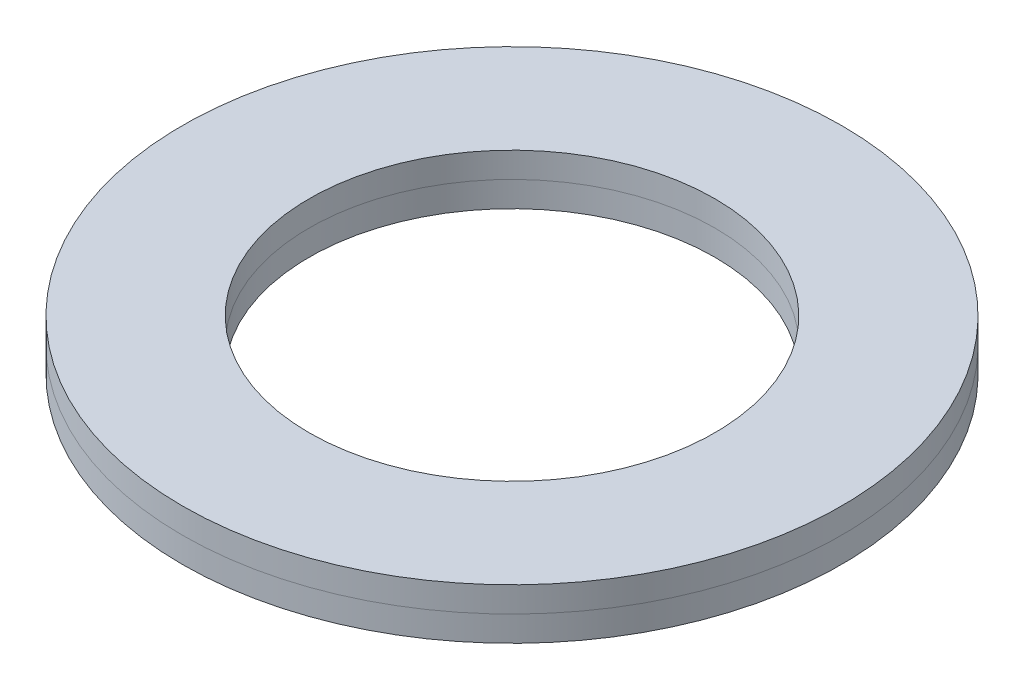
ISO-10303-21;
HEADER;
FILE_DESCRIPTION(('STEP AP214'),'2;1');
FILE_NAME('part.step','',(''),(''),'','','');
FILE_SCHEMA(('AUTOMOTIVE_DESIGN { 1 0 10303 214 1 1 1 1 }'));
ENDSEC;
DATA;
#1=APPLICATION_CONTEXT('core data for automotive mechanical design processes');
#2=APPLICATION_PROTOCOL_DEFINITION('international standard','automotive_design',2000,#1);
#3=PRODUCT_CONTEXT('',#1,'mechanical');
#4=PRODUCT('Part','Part','',(#3));
#5=PRODUCT_RELATED_PRODUCT_CATEGORY('part','',(#4));
#6=PRODUCT_DEFINITION_FORMATION('','',#4);
#7=PRODUCT_DEFINITION_CONTEXT('part definition',#1,'design');
#8=PRODUCT_DEFINITION('design','',#6,#7);
#9=PRODUCT_DEFINITION_SHAPE('','',#8);
#10=(LENGTH_UNIT() NAMED_UNIT(*) SI_UNIT(.MILLI.,.METRE.));
#11=(NAMED_UNIT(*) PLANE_ANGLE_UNIT() SI_UNIT($,.RADIAN.));
#12=(NAMED_UNIT(*) SI_UNIT($,.STERADIAN.) SOLID_ANGLE_UNIT());
#13=UNCERTAINTY_MEASURE_WITH_UNIT(LENGTH_MEASURE(1.E-05),#10,'distance_accuracy_value','');
#14=(GEOMETRIC_REPRESENTATION_CONTEXT(3) GLOBAL_UNCERTAINTY_ASSIGNED_CONTEXT((#13)) GLOBAL_UNIT_ASSIGNED_CONTEXT((#10,
#11,#12)) REPRESENTATION_CONTEXT('',''));
#15=CARTESIAN_POINT('',(0.,0.,0.));
#16=DIRECTION('',(0.,0.,1.));
#17=DIRECTION('',(1.,0.,0.));
#18=AXIS2_PLACEMENT_3D('',#15,#16,#17);
#19=CARTESIAN_POINT('',(0.,1.,0.));
#20=DIRECTION('',(0.,1.,0.));
#21=DIRECTION('',(0.,0.,1.));
#22=AXIS2_PLACEMENT_3D('',#19,#20,#21);
#23=PLANE('',#22);
#24=CARTESIAN_POINT('',(0.,1.,0.));
#25=DIRECTION('',(0.,-1.,0.));
#26=DIRECTION('',(0.,0.,-1.));
#27=AXIS2_PLACEMENT_3D('',#24,#25,#26);
#28=CIRCLE('',#27,8.);
#29=CARTESIAN_POINT('',(0.,1.,-8.));
#30=VERTEX_POINT('',#29);
#31=EDGE_CURVE('P0_E17',#30,#30,#28,.T.);
#32=ORIENTED_EDGE('',*,*,#31,.T.);
#33=EDGE_LOOP('',(#32));
#34=FACE_BOUND('',#33,.T.);
#35=CARTESIAN_POINT('',(0.,1.,0.));
#36=DIRECTION('',(0.,-1.,0.));
#37=DIRECTION('',(0.,0.,-1.));
#38=AXIS2_PLACEMENT_3D('',#35,#36,#37);
#39=CIRCLE('',#38,13.);
#40=CARTESIAN_POINT('',(0.,1.,-13.));
#41=VERTEX_POINT('',#40);
#42=EDGE_CURVE('P0_E26',#41,#41,#39,.T.);
#43=ORIENTED_EDGE('',*,*,#42,.F.);
#44=EDGE_LOOP('',(#43));
#45=FACE_BOUND('',#44,.T.);
#46=ADVANCED_FACE('P0_F14',(#34,#45),#23,.T.);
#47=CARTESIAN_POINT('',(0.,0.,0.));
#48=DIRECTION('',(0.,-1.,0.));
#49=DIRECTION('',(0.,0.,-1.));
#50=AXIS2_PLACEMENT_3D('',#47,#48,#49);
#51=CYLINDRICAL_SURFACE('',#50,8.);
#52=ORIENTED_EDGE('',*,*,#31,.F.);
#53=EDGE_LOOP('',(#52));
#54=FACE_BOUND('',#53,.T.);
#55=CARTESIAN_POINT('',(0.,0.,0.));
#56=DIRECTION('',(0.,-1.,0.));
#57=DIRECTION('',(0.,0.,-1.));
#58=AXIS2_PLACEMENT_3D('',#55,#56,#57);
#59=CIRCLE('',#58,8.);
#60=CARTESIAN_POINT('',(0.,0.,-8.));
#61=VERTEX_POINT('',#60);
#62=EDGE_CURVE('P0_E21',#61,#61,#59,.T.);
#63=ORIENTED_EDGE('',*,*,#62,.T.);
#64=EDGE_LOOP('',(#63));
#65=FACE_BOUND('',#64,.T.);
#66=ADVANCED_FACE('P0_F36',(#54,#65),#51,.F.);
#67=CARTESIAN_POINT('',(0.,0.,0.));
#68=DIRECTION('',(0.,-1.,0.));
#69=DIRECTION('',(0.,0.,-1.));
#70=AXIS2_PLACEMENT_3D('',#67,#68,#69);
#71=CYLINDRICAL_SURFACE('',#70,13.);
#72=CARTESIAN_POINT('',(0.,0.,0.));
#73=DIRECTION('',(0.,-1.,0.));
#74=DIRECTION('',(0.,0.,-1.));
#75=AXIS2_PLACEMENT_3D('',#72,#73,#74);
#76=CIRCLE('',#75,13.);
#77=CARTESIAN_POINT('',(0.,0.,-13.));
#78=VERTEX_POINT('',#77);
#79=EDGE_CURVE('P0_E9',#78,#78,#76,.F.);
#80=ORIENTED_EDGE('',*,*,#79,.T.);
#81=EDGE_LOOP('',(#80));
#82=FACE_BOUND('',#81,.T.);
#83=ORIENTED_EDGE('',*,*,#42,.T.);
#84=EDGE_LOOP('',(#83));
#85=FACE_BOUND('',#84,.T.);
#86=ADVANCED_FACE('P0_F39',(#82,#85),#71,.T.);
#87=CARTESIAN_POINT('',(-13.,0.,0.));
#88=DIRECTION('',(0.,1.,0.));
#89=DIRECTION('',(0.,0.,1.));
#90=AXIS2_PLACEMENT_3D('',#87,#88,#89);
#91=PLANE('',#90);
#92=ORIENTED_EDGE('',*,*,#79,.F.);
#93=EDGE_LOOP('',(#92));
#94=FACE_BOUND('',#93,.T.);
#95=ORIENTED_EDGE('',*,*,#62,.F.);
#96=EDGE_LOOP('',(#95));
#97=FACE_BOUND('',#96,.T.);
#98=ADVANCED_FACE('P0_F42',(#94,#97),#91,.F.);
#99=CLOSED_SHELL('',(#46,#66,#86,#98));
#100=MANIFOLD_SOLID_BREP('P0_B1',#99);
#101=CARTESIAN_POINT('',(0.,1.,0.));
#102=DIRECTION('',(0.,1.,0.));
#103=DIRECTION('',(0.,0.,1.));
#104=AXIS2_PLACEMENT_3D('',#101,#102,#103);
#105=PLANE('',#104);
#106=CARTESIAN_POINT('',(0.,1.,0.));
#107=DIRECTION('',(0.,-1.,0.));
#108=DIRECTION('',(0.,0.,-1.));
#109=AXIS2_PLACEMENT_3D('',#106,#107,#108);
#110=CIRCLE('',#109,13.);
#111=CARTESIAN_POINT('',(0.,1.,-13.));
#112=VERTEX_POINT('',#111);
#113=EDGE_CURVE('P1_E18',#112,#112,#110,.F.);
#114=ORIENTED_EDGE('',*,*,#113,.F.);
#115=EDGE_LOOP('',(#114));
#116=FACE_BOUND('',#115,.T.);
#117=CARTESIAN_POINT('',(0.,1.,0.));
#118=DIRECTION('',(0.,-1.,0.));
#119=DIRECTION('',(0.,0.,-1.));
#120=AXIS2_PLACEMENT_3D('',#117,#118,#119);
#121=CIRCLE('',#120,8.);
#122=CARTESIAN_POINT('',(0.,1.,-8.));
#123=VERTEX_POINT('',#122);
#124=EDGE_CURVE('P1_E30',#123,#123,#121,.F.);
#125=ORIENTED_EDGE('',*,*,#124,.T.);
#126=EDGE_LOOP('',(#125));
#127=FACE_BOUND('',#126,.T.);
#128=ADVANCED_FACE('P1_F15',(#116,#127),#105,.F.);
#129=CARTESIAN_POINT('',(0.,0.,0.));
#130=DIRECTION('',(0.,-1.,0.));
#131=DIRECTION('',(0.,0.,-1.));
#132=AXIS2_PLACEMENT_3D('',#129,#130,#131);
#133=CYLINDRICAL_SURFACE('',#132,13.);
#134=ORIENTED_EDGE('',*,*,#113,.T.);
#135=EDGE_LOOP('',(#134));
#136=FACE_BOUND('',#135,.T.);
#137=CARTESIAN_POINT('',(0.,2.,0.));
#138=DIRECTION('',(0.,-1.,0.));
#139=DIRECTION('',(0.,0.,-1.));
#140=AXIS2_PLACEMENT_3D('',#137,#138,#139);
#141=CIRCLE('',#140,13.);
#142=CARTESIAN_POINT('',(0.,2.,-13.));
#143=VERTEX_POINT('',#142);
#144=EDGE_CURVE('P1_E23',#143,#143,#141,.T.);
#145=ORIENTED_EDGE('',*,*,#144,.T.);
#146=EDGE_LOOP('',(#145));
#147=FACE_BOUND('',#146,.T.);
#148=ADVANCED_FACE('P1_F40',(#136,#147),#133,.T.);
#149=CARTESIAN_POINT('',(0.,0.,0.));
#150=DIRECTION('',(0.,-1.,0.));
#151=DIRECTION('',(0.,0.,-1.));
#152=AXIS2_PLACEMENT_3D('',#149,#150,#151);
#153=CYLINDRICAL_SURFACE('',#152,8.);
#154=CARTESIAN_POINT('',(0.,2.,0.));
#155=DIRECTION('',(0.,-1.,0.));
#156=DIRECTION('',(0.,0.,-1.));
#157=AXIS2_PLACEMENT_3D('',#154,#155,#156);
#158=CIRCLE('',#157,8.);
#159=CARTESIAN_POINT('',(0.,2.,-8.));
#160=VERTEX_POINT('',#159);
#161=EDGE_CURVE('P1_E10',#160,#160,#158,.F.);
#162=ORIENTED_EDGE('',*,*,#161,.T.);
#163=EDGE_LOOP('',(#162));
#164=FACE_BOUND('',#163,.T.);
#165=ORIENTED_EDGE('',*,*,#124,.F.);
#166=EDGE_LOOP('',(#165));
#167=FACE_BOUND('',#166,.T.);
#168=ADVANCED_FACE('P1_F48',(#164,#167),#153,.F.);
#169=CARTESIAN_POINT('',(-13.,2.,0.));
#170=DIRECTION('',(0.,-1.,0.));
#171=DIRECTION('',(0.,0.,-1.));
#172=AXIS2_PLACEMENT_3D('',#169,#170,#171);
#173=PLANE('',#172);
#174=ORIENTED_EDGE('',*,*,#161,.F.);
#175=EDGE_LOOP('',(#174));
#176=FACE_BOUND('',#175,.T.);
#177=ORIENTED_EDGE('',*,*,#144,.F.);
#178=EDGE_LOOP('',(#177));
#179=FACE_BOUND('',#178,.T.);
#180=ADVANCED_FACE('P1_F49',(#176,#179),#173,.F.);
#181=CLOSED_SHELL('',(#128,#148,#168,#180));
#182=MANIFOLD_SOLID_BREP('P1_B1',#181);
#183=ADVANCED_BREP_SHAPE_REPRESENTATION('',(#18,#100,#182),#14);
#184=SHAPE_DEFINITION_REPRESENTATION(#9,#183);
ENDSEC;
END-ISO-10303-21;
